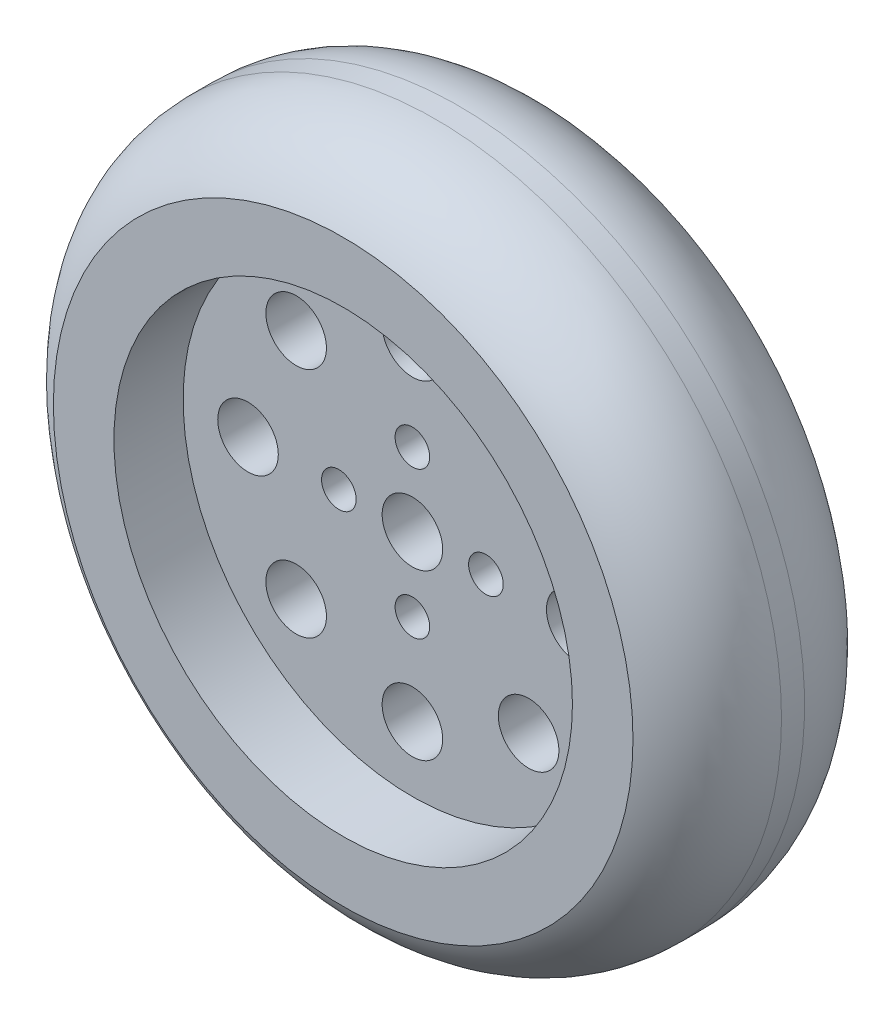
ISO-10303-21;
HEADER;
FILE_DESCRIPTION(('STEP AP214'),'2;1');
FILE_NAME('part.step','',(''),(''),'','','');
FILE_SCHEMA(('AUTOMOTIVE_DESIGN { 1 0 10303 214 1 1 1 1 }'));
ENDSEC;
DATA;
#1=APPLICATION_CONTEXT('core data for automotive mechanical design processes');
#2=APPLICATION_PROTOCOL_DEFINITION('international standard','automotive_design',2000,#1);
#3=PRODUCT_CONTEXT('',#1,'mechanical');
#4=PRODUCT('Part','Part','',(#3));
#5=PRODUCT_RELATED_PRODUCT_CATEGORY('part','',(#4));
#6=PRODUCT_DEFINITION_FORMATION('','',#4);
#7=PRODUCT_DEFINITION_CONTEXT('part definition',#1,'design');
#8=PRODUCT_DEFINITION('design','',#6,#7);
#9=PRODUCT_DEFINITION_SHAPE('','',#8);
#10=(LENGTH_UNIT() NAMED_UNIT(*) SI_UNIT(.MILLI.,.METRE.));
#11=(NAMED_UNIT(*) PLANE_ANGLE_UNIT() SI_UNIT($,.RADIAN.));
#12=(NAMED_UNIT(*) SI_UNIT($,.STERADIAN.) SOLID_ANGLE_UNIT());
#13=UNCERTAINTY_MEASURE_WITH_UNIT(LENGTH_MEASURE(1.E-05),#10,'distance_accuracy_value','');
#14=(GEOMETRIC_REPRESENTATION_CONTEXT(3) GLOBAL_UNCERTAINTY_ASSIGNED_CONTEXT((#13)) GLOBAL_UNIT_ASSIGNED_CONTEXT((#10,
#11,#12)) REPRESENTATION_CONTEXT('',''));
#15=CARTESIAN_POINT('',(0.,0.,0.));
#16=DIRECTION('',(0.,0.,1.));
#17=DIRECTION('',(1.,0.,0.));
#18=AXIS2_PLACEMENT_3D('',#15,#16,#17);
#19=CARTESIAN_POINT('',(0.,0.,24.));
#20=DIRECTION('',(0.,0.,-1.));
#21=DIRECTION('',(-1.,0.,0.));
#22=AXIS2_PLACEMENT_3D('',#19,#20,#21);
#23=CYLINDRICAL_SURFACE('',#22,40.);
#24=CARTESIAN_POINT('',(0.,0.,13.3346354961492));
#25=DIRECTION('',(0.,0.,1.));
#26=DIRECTION('',(1.,0.,0.));
#27=AXIS2_PLACEMENT_3D('',#24,#25,#26);
#28=CIRCLE('',#27,40.);
#29=CARTESIAN_POINT('',(40.,0.,13.3346354961492));
#30=VERTEX_POINT('',#29);
#31=EDGE_CURVE('E44',#30,#30,#28,.F.);
#32=ORIENTED_EDGE('',*,*,#31,.T.);
#33=EDGE_LOOP('',(#32));
#34=FACE_BOUND('',#33,.T.);
#35=CARTESIAN_POINT('',(0.,0.,10.6653645038508));
#36=DIRECTION('',(0.,0.,-1.));
#37=DIRECTION('',(-1.,0.,0.));
#38=AXIS2_PLACEMENT_3D('',#35,#36,#37);
#39=CIRCLE('',#38,40.);
#40=CARTESIAN_POINT('',(-40.,0.,10.6653645038508));
#41=VERTEX_POINT('',#40);
#42=EDGE_CURVE('E48',#41,#41,#39,.F.);
#43=ORIENTED_EDGE('',*,*,#42,.T.);
#44=EDGE_LOOP('',(#43));
#45=FACE_BOUND('',#44,.T.);
#46=ADVANCED_FACE('F33',(#34,#45),#23,.T.);
#47=CARTESIAN_POINT('',(0.,0.,10.6653645038508));
#48=DIRECTION('',(0.,0.,-1.));
#49=DIRECTION('',(-1.,0.,0.));
#50=AXIS2_PLACEMENT_3D('',#47,#48,#49);
#51=TOROIDAL_SURFACE('',#50,28.,12.);
#52=CARTESIAN_POINT('',(0.,0.,0.));
#53=DIRECTION('',(0.,0.,-1.));
#54=DIRECTION('',(-1.,0.,0.));
#55=AXIS2_PLACEMENT_3D('',#52,#53,#54);
#56=CIRCLE('',#55,33.5);
#57=CARTESIAN_POINT('',(-33.5,0.,0.));
#58=VERTEX_POINT('',#57);
#59=EDGE_CURVE('E53',#58,#58,#56,.T.);
#60=ORIENTED_EDGE('',*,*,#59,.F.);
#61=EDGE_LOOP('',(#60));
#62=FACE_BOUND('',#61,.T.);
#63=ORIENTED_EDGE('',*,*,#42,.F.);
#64=EDGE_LOOP('',(#63));
#65=FACE_BOUND('',#64,.T.);
#66=ADVANCED_FACE('F189',(#62,#65),#51,.T.);
#67=CARTESIAN_POINT('',(0.,0.,13.3346354961492));
#68=DIRECTION('',(0.,0.,1.));
#69=DIRECTION('',(1.,0.,0.));
#70=AXIS2_PLACEMENT_3D('',#67,#68,#69);
#71=TOROIDAL_SURFACE('',#70,28.,12.);
#72=ORIENTED_EDGE('',*,*,#31,.F.);
#73=EDGE_LOOP('',(#72));
#74=FACE_BOUND('',#73,.T.);
#75=CARTESIAN_POINT('',(0.,0.,24.));
#76=DIRECTION('',(0.,0.,1.));
#77=DIRECTION('',(1.,0.,0.));
#78=AXIS2_PLACEMENT_3D('',#75,#76,#77);
#79=CIRCLE('',#78,33.5);
#80=CARTESIAN_POINT('',(33.5,0.,24.));
#81=VERTEX_POINT('',#80);
#82=EDGE_CURVE('E56',#81,#81,#79,.T.);
#83=ORIENTED_EDGE('',*,*,#82,.F.);
#84=EDGE_LOOP('',(#83));
#85=FACE_BOUND('',#84,.T.);
#86=ADVANCED_FACE('F35',(#74,#85),#71,.T.);
#87=CARTESIAN_POINT('',(0.,0.,24.));
#88=DIRECTION('',(0.,0.,1.));
#89=DIRECTION('',(1.,0.,0.));
#90=AXIS2_PLACEMENT_3D('',#87,#88,#89);
#91=PLANE('',#90);
#92=ORIENTED_EDGE('',*,*,#82,.T.);
#93=EDGE_LOOP('',(#92));
#94=FACE_BOUND('',#93,.T.);
#95=CARTESIAN_POINT('',(0.,0.,24.));
#96=DIRECTION('',(0.,0.,1.));
#97=DIRECTION('',(1.,0.,0.));
#98=AXIS2_PLACEMENT_3D('',#95,#96,#97);
#99=CIRCLE('',#98,26.5);
#100=CARTESIAN_POINT('',(26.5,0.,24.));
#101=VERTEX_POINT('',#100);
#102=EDGE_CURVE('E59',#101,#101,#99,.T.);
#103=ORIENTED_EDGE('',*,*,#102,.F.);
#104=EDGE_LOOP('',(#103));
#105=FACE_BOUND('',#104,.T.);
#106=ADVANCED_FACE('F204',(#94,#105),#91,.T.);
#107=CARTESIAN_POINT('',(0.,0.,24.));
#108=DIRECTION('',(0.,0.,-1.));
#109=DIRECTION('',(-1.,0.,0.));
#110=AXIS2_PLACEMENT_3D('',#107,#108,#109);
#111=CYLINDRICAL_SURFACE('',#110,26.5);
#112=ORIENTED_EDGE('',*,*,#102,.T.);
#113=EDGE_LOOP('',(#112));
#114=FACE_BOUND('',#113,.T.);
#115=CARTESIAN_POINT('',(0.,0.,16.));
#116=DIRECTION('',(0.,0.,1.));
#117=DIRECTION('',(1.,0.,0.));
#118=AXIS2_PLACEMENT_3D('',#115,#116,#117);
#119=CIRCLE('',#118,26.5);
#120=CARTESIAN_POINT('',(26.5,0.,16.));
#121=VERTEX_POINT('',#120);
#122=EDGE_CURVE('E40',#121,#121,#119,.F.);
#123=ORIENTED_EDGE('',*,*,#122,.T.);
#124=EDGE_LOOP('',(#123));
#125=FACE_BOUND('',#124,.T.);
#126=ADVANCED_FACE('F202',(#114,#125),#111,.F.);
#127=CARTESIAN_POINT('',(0.,0.,16.));
#128=DIRECTION('',(0.,0.,1.));
#129=DIRECTION('',(1.,0.,0.));
#130=AXIS2_PLACEMENT_3D('',#127,#128,#129);
#131=PLANE('',#130);
#132=CARTESIAN_POINT('',(13.4350288425446,-13.4350288425442,16.));
#133=DIRECTION('',(0.,0.,1.));
#134=DIRECTION('',(1.,0.,0.));
#135=AXIS2_PLACEMENT_3D('',#132,#133,#134);
#136=CIRCLE('',#135,3.5);
#137=CARTESIAN_POINT('',(16.9350288425446,-13.4350288425442,16.));
#138=VERTEX_POINT('',#137);
#139=EDGE_CURVE('E137',#138,#138,#136,.T.);
#140=ORIENTED_EDGE('',*,*,#139,.F.);
#141=EDGE_LOOP('',(#140));
#142=FACE_BOUND('',#141,.T.);
#143=CARTESIAN_POINT('',(1.99014436314059E-13,-19.,16.));
#144=DIRECTION('',(0.,0.,1.));
#145=DIRECTION('',(1.,0.,0.));
#146=AXIS2_PLACEMENT_3D('',#143,#144,#145);
#147=CIRCLE('',#146,3.5);
#148=CARTESIAN_POINT('',(3.5000000000002,-19.,16.));
#149=VERTEX_POINT('',#148);
#150=EDGE_CURVE('E131',#149,#149,#147,.T.);
#151=ORIENTED_EDGE('',*,*,#150,.F.);
#152=EDGE_LOOP('',(#151));
#153=FACE_BOUND('',#152,.T.);
#154=CARTESIAN_POINT('',(-13.4350288425443,-13.4350288425445,16.));
#155=DIRECTION('',(0.,0.,1.));
#156=DIRECTION('',(1.,0.,0.));
#157=AXIS2_PLACEMENT_3D('',#154,#155,#156);
#158=CIRCLE('',#157,3.5);
#159=CARTESIAN_POINT('',(-9.93502884254429,-13.4350288425445,16.));
#160=VERTEX_POINT('',#159);
#161=EDGE_CURVE('E125',#160,#160,#158,.T.);
#162=ORIENTED_EDGE('',*,*,#161,.F.);
#163=EDGE_LOOP('',(#162));
#164=FACE_BOUND('',#163,.T.);
#165=CARTESIAN_POINT('',(-19.,-1.32676290876039E-13,16.));
#166=DIRECTION('',(0.,0.,1.));
#167=DIRECTION('',(1.,0.,0.));
#168=AXIS2_PLACEMENT_3D('',#165,#166,#167);
#169=CIRCLE('',#168,3.5);
#170=CARTESIAN_POINT('',(-15.5,-1.32676290876039E-13,16.));
#171=VERTEX_POINT('',#170);
#172=EDGE_CURVE('E119',#171,#171,#169,.T.);
#173=ORIENTED_EDGE('',*,*,#172,.F.);
#174=EDGE_LOOP('',(#173));
#175=FACE_BOUND('',#174,.T.);
#176=CARTESIAN_POINT('',(-13.4350288425445,13.4350288425443,16.));
#177=DIRECTION('',(0.,0.,1.));
#178=DIRECTION('',(1.,0.,0.));
#179=AXIS2_PLACEMENT_3D('',#176,#177,#178);
#180=CIRCLE('',#179,3.5);
#181=CARTESIAN_POINT('',(-9.93502884254448,13.4350288425443,16.));
#182=VERTEX_POINT('',#181);
#183=EDGE_CURVE('E113',#182,#182,#180,.T.);
#184=ORIENTED_EDGE('',*,*,#183,.F.);
#185=EDGE_LOOP('',(#184));
#186=FACE_BOUND('',#185,.T.);
#187=CARTESIAN_POINT('',(0.,19.,16.));
#188=DIRECTION('',(0.,0.,1.));
#189=DIRECTION('',(1.,0.,0.));
#190=AXIS2_PLACEMENT_3D('',#187,#188,#189);
#191=CIRCLE('',#190,3.5);
#192=CARTESIAN_POINT('',(3.49999999999993,19.,16.));
#193=VERTEX_POINT('',#192);
#194=EDGE_CURVE('E107',#193,#193,#191,.T.);
#195=ORIENTED_EDGE('',*,*,#194,.F.);
#196=EDGE_LOOP('',(#195));
#197=FACE_BOUND('',#196,.T.);
#198=CARTESIAN_POINT('',(13.4350288425444,13.4350288425444,16.));
#199=DIRECTION('',(0.,0.,1.));
#200=DIRECTION('',(1.,0.,0.));
#201=AXIS2_PLACEMENT_3D('',#198,#199,#200);
#202=CIRCLE('',#201,3.5);
#203=CARTESIAN_POINT('',(16.9350288425444,13.4350288425444,16.));
#204=VERTEX_POINT('',#203);
#205=EDGE_CURVE('E101',#204,#204,#202,.T.);
#206=ORIENTED_EDGE('',*,*,#205,.F.);
#207=EDGE_LOOP('',(#206));
#208=FACE_BOUND('',#207,.T.);
#209=CARTESIAN_POINT('',(0.,-8.5,16.));
#210=DIRECTION('',(0.,0.,1.));
#211=DIRECTION('',(1.,0.,0.));
#212=AXIS2_PLACEMENT_3D('',#209,#210,#211);
#213=CIRCLE('',#212,2.);
#214=CARTESIAN_POINT('',(2.00000000000009,-8.5,16.));
#215=VERTEX_POINT('',#214);
#216=EDGE_CURVE('E95',#215,#215,#213,.T.);
#217=ORIENTED_EDGE('',*,*,#216,.F.);
#218=EDGE_LOOP('',(#217));
#219=FACE_BOUND('',#218,.T.);
#220=CARTESIAN_POINT('',(-8.5,0.,16.));
#221=DIRECTION('',(0.,0.,1.));
#222=DIRECTION('',(1.,0.,0.));
#223=AXIS2_PLACEMENT_3D('',#220,#221,#222);
#224=CIRCLE('',#223,2.);
#225=CARTESIAN_POINT('',(-6.5,0.,16.));
#226=VERTEX_POINT('',#225);
#227=EDGE_CURVE('E89',#226,#226,#224,.T.);
#228=ORIENTED_EDGE('',*,*,#227,.F.);
#229=EDGE_LOOP('',(#228));
#230=FACE_BOUND('',#229,.T.);
#231=CARTESIAN_POINT('',(0.,8.5,16.));
#232=DIRECTION('',(0.,0.,1.));
#233=DIRECTION('',(1.,0.,0.));
#234=AXIS2_PLACEMENT_3D('',#231,#232,#233);
#235=CIRCLE('',#234,2.);
#236=CARTESIAN_POINT('',(1.99999999999997,8.5,16.));
#237=VERTEX_POINT('',#236);
#238=EDGE_CURVE('E83',#237,#237,#235,.T.);
#239=ORIENTED_EDGE('',*,*,#238,.F.);
#240=EDGE_LOOP('',(#239));
#241=FACE_BOUND('',#240,.T.);
#242=CARTESIAN_POINT('',(19.,0.,16.));
#243=DIRECTION('',(0.,0.,1.));
#244=DIRECTION('',(1.,0.,0.));
#245=AXIS2_PLACEMENT_3D('',#242,#243,#244);
#246=CIRCLE('',#245,3.5);
#247=CARTESIAN_POINT('',(22.5,0.,16.));
#248=VERTEX_POINT('',#247);
#249=EDGE_CURVE('E77',#248,#248,#246,.T.);
#250=ORIENTED_EDGE('',*,*,#249,.F.);
#251=EDGE_LOOP('',(#250));
#252=FACE_BOUND('',#251,.T.);
#253=CARTESIAN_POINT('',(8.5,0.,16.));
#254=DIRECTION('',(0.,0.,1.));
#255=DIRECTION('',(1.,0.,0.));
#256=AXIS2_PLACEMENT_3D('',#253,#254,#255);
#257=CIRCLE('',#256,2.);
#258=CARTESIAN_POINT('',(10.5,0.,16.));
#259=VERTEX_POINT('',#258);
#260=EDGE_CURVE('E71',#259,#259,#257,.T.);
#261=ORIENTED_EDGE('',*,*,#260,.F.);
#262=EDGE_LOOP('',(#261));
#263=FACE_BOUND('',#262,.T.);
#264=CARTESIAN_POINT('',(0.,0.,16.));
#265=DIRECTION('',(0.,0.,1.));
#266=DIRECTION('',(1.,0.,0.));
#267=AXIS2_PLACEMENT_3D('',#264,#265,#266);
#268=CIRCLE('',#267,3.5);
#269=CARTESIAN_POINT('',(3.5,0.,16.));
#270=VERTEX_POINT('',#269);
#271=EDGE_CURVE('E65',#270,#270,#268,.T.);
#272=ORIENTED_EDGE('',*,*,#271,.F.);
#273=EDGE_LOOP('',(#272));
#274=FACE_BOUND('',#273,.T.);
#275=ORIENTED_EDGE('',*,*,#122,.F.);
#276=EDGE_LOOP('',(#275));
#277=FACE_BOUND('',#276,.T.);
#278=ADVANCED_FACE('F198',(#142,#153,#164,#175,#186,#197,#208,#219,#230,#241,#252,#263,#274,
#277),#131,.T.);
#279=CARTESIAN_POINT('',(0.,0.,0.));
#280=DIRECTION('',(0.,0.,-1.));
#281=DIRECTION('',(-1.,0.,0.));
#282=AXIS2_PLACEMENT_3D('',#279,#280,#281);
#283=PLANE('',#282);
#284=ORIENTED_EDGE('',*,*,#59,.T.);
#285=EDGE_LOOP('',(#284));
#286=FACE_BOUND('',#285,.T.);
#287=CARTESIAN_POINT('',(0.,0.,0.));
#288=DIRECTION('',(0.,0.,-1.));
#289=DIRECTION('',(-1.,0.,0.));
#290=AXIS2_PLACEMENT_3D('',#287,#288,#289);
#291=CIRCLE('',#290,26.5);
#292=CARTESIAN_POINT('',(-26.5,0.,0.));
#293=VERTEX_POINT('',#292);
#294=EDGE_CURVE('E62',#293,#293,#291,.T.);
#295=ORIENTED_EDGE('',*,*,#294,.F.);
#296=EDGE_LOOP('',(#295));
#297=FACE_BOUND('',#296,.T.);
#298=ADVANCED_FACE('F201',(#286,#297),#283,.T.);
#299=CARTESIAN_POINT('',(0.,0.,0.));
#300=DIRECTION('',(0.,0.,1.));
#301=DIRECTION('',(1.,0.,0.));
#302=AXIS2_PLACEMENT_3D('',#299,#300,#301);
#303=CYLINDRICAL_SURFACE('',#302,26.5);
#304=ORIENTED_EDGE('',*,*,#294,.T.);
#305=EDGE_LOOP('',(#304));
#306=FACE_BOUND('',#305,.T.);
#307=CARTESIAN_POINT('',(0.,0.,8.));
#308=DIRECTION('',(0.,0.,-1.));
#309=DIRECTION('',(-1.,0.,0.));
#310=AXIS2_PLACEMENT_3D('',#307,#308,#309);
#311=CIRCLE('',#310,26.5);
#312=CARTESIAN_POINT('',(-26.5,0.,8.));
#313=VERTEX_POINT('',#312);
#314=EDGE_CURVE('E10',#313,#313,#311,.F.);
#315=ORIENTED_EDGE('',*,*,#314,.T.);
#316=EDGE_LOOP('',(#315));
#317=FACE_BOUND('',#316,.T.);
#318=ADVANCED_FACE('F150',(#306,#317),#303,.F.);
#319=CARTESIAN_POINT('',(0.,0.,8.));
#320=DIRECTION('',(0.,0.,-1.));
#321=DIRECTION('',(-1.,0.,0.));
#322=AXIS2_PLACEMENT_3D('',#319,#320,#321);
#323=PLANE('',#322);
#324=CARTESIAN_POINT('',(13.4350288425446,-13.4350288425442,8.));
#325=DIRECTION('',(0.,0.,-1.));
#326=DIRECTION('',(-1.,0.,0.));
#327=AXIS2_PLACEMENT_3D('',#324,#325,#326);
#328=CIRCLE('',#327,3.5);
#329=CARTESIAN_POINT('',(9.93502884254457,-13.4350288425442,8.));
#330=VERTEX_POINT('',#329);
#331=EDGE_CURVE('E140',#330,#330,#328,.T.);
#332=ORIENTED_EDGE('',*,*,#331,.F.);
#333=EDGE_LOOP('',(#332));
#334=FACE_BOUND('',#333,.T.);
#335=CARTESIAN_POINT('',(1.99014436314059E-13,-19.,8.));
#336=DIRECTION('',(0.,0.,-1.));
#337=DIRECTION('',(-1.,0.,0.));
#338=AXIS2_PLACEMENT_3D('',#335,#336,#337);
#339=CIRCLE('',#338,3.5);
#340=CARTESIAN_POINT('',(-3.4999999999998,-19.,8.));
#341=VERTEX_POINT('',#340);
#342=EDGE_CURVE('E134',#341,#341,#339,.T.);
#343=ORIENTED_EDGE('',*,*,#342,.F.);
#344=EDGE_LOOP('',(#343));
#345=FACE_BOUND('',#344,.T.);
#346=CARTESIAN_POINT('',(-13.4350288425443,-13.4350288425445,8.));
#347=DIRECTION('',(0.,0.,-1.));
#348=DIRECTION('',(-1.,0.,0.));
#349=AXIS2_PLACEMENT_3D('',#346,#347,#348);
#350=CIRCLE('',#349,3.5);
#351=CARTESIAN_POINT('',(-16.9350288425443,-13.4350288425445,8.));
#352=VERTEX_POINT('',#351);
#353=EDGE_CURVE('E128',#352,#352,#350,.T.);
#354=ORIENTED_EDGE('',*,*,#353,.F.);
#355=EDGE_LOOP('',(#354));
#356=FACE_BOUND('',#355,.T.);
#357=CARTESIAN_POINT('',(-19.,-1.32676290876039E-13,8.));
#358=DIRECTION('',(0.,0.,-1.));
#359=DIRECTION('',(-1.,0.,0.));
#360=AXIS2_PLACEMENT_3D('',#357,#358,#359);
#361=CIRCLE('',#360,3.5);
#362=CARTESIAN_POINT('',(-22.5,-1.32676290876039E-13,8.));
#363=VERTEX_POINT('',#362);
#364=EDGE_CURVE('E122',#363,#363,#361,.T.);
#365=ORIENTED_EDGE('',*,*,#364,.F.);
#366=EDGE_LOOP('',(#365));
#367=FACE_BOUND('',#366,.T.);
#368=CARTESIAN_POINT('',(-13.4350288425445,13.4350288425443,8.));
#369=DIRECTION('',(0.,0.,-1.));
#370=DIRECTION('',(-1.,0.,0.));
#371=AXIS2_PLACEMENT_3D('',#368,#369,#370);
#372=CIRCLE('',#371,3.5);
#373=CARTESIAN_POINT('',(-16.9350288425445,13.4350288425443,8.));
#374=VERTEX_POINT('',#373);
#375=EDGE_CURVE('E116',#374,#374,#372,.T.);
#376=ORIENTED_EDGE('',*,*,#375,.F.);
#377=EDGE_LOOP('',(#376));
#378=FACE_BOUND('',#377,.T.);
#379=CARTESIAN_POINT('',(0.,19.,8.));
#380=DIRECTION('',(0.,0.,-1.));
#381=DIRECTION('',(-1.,0.,0.));
#382=AXIS2_PLACEMENT_3D('',#379,#380,#381);
#383=CIRCLE('',#382,3.5);
#384=CARTESIAN_POINT('',(-3.50000000000007,19.,8.));
#385=VERTEX_POINT('',#384);
#386=EDGE_CURVE('E110',#385,#385,#383,.T.);
#387=ORIENTED_EDGE('',*,*,#386,.F.);
#388=EDGE_LOOP('',(#387));
#389=FACE_BOUND('',#388,.T.);
#390=CARTESIAN_POINT('',(13.4350288425444,13.4350288425444,8.));
#391=DIRECTION('',(0.,0.,-1.));
#392=DIRECTION('',(-1.,0.,0.));
#393=AXIS2_PLACEMENT_3D('',#390,#391,#392);
#394=CIRCLE('',#393,3.5);
#395=CARTESIAN_POINT('',(9.93502884254438,13.4350288425444,8.));
#396=VERTEX_POINT('',#395);
#397=EDGE_CURVE('E104',#396,#396,#394,.T.);
#398=ORIENTED_EDGE('',*,*,#397,.F.);
#399=EDGE_LOOP('',(#398));
#400=FACE_BOUND('',#399,.T.);
#401=CARTESIAN_POINT('',(0.,-8.5,8.));
#402=DIRECTION('',(0.,0.,-1.));
#403=DIRECTION('',(-1.,0.,0.));
#404=AXIS2_PLACEMENT_3D('',#401,#402,#403);
#405=CIRCLE('',#404,2.);
#406=CARTESIAN_POINT('',(-1.99999999999991,-8.5,8.));
#407=VERTEX_POINT('',#406);
#408=EDGE_CURVE('E98',#407,#407,#405,.T.);
#409=ORIENTED_EDGE('',*,*,#408,.F.);
#410=EDGE_LOOP('',(#409));
#411=FACE_BOUND('',#410,.T.);
#412=CARTESIAN_POINT('',(-8.5,0.,8.));
#413=DIRECTION('',(0.,0.,-1.));
#414=DIRECTION('',(-1.,0.,0.));
#415=AXIS2_PLACEMENT_3D('',#412,#413,#414);
#416=CIRCLE('',#415,2.);
#417=CARTESIAN_POINT('',(-10.5,0.,8.));
#418=VERTEX_POINT('',#417);
#419=EDGE_CURVE('E92',#418,#418,#416,.T.);
#420=ORIENTED_EDGE('',*,*,#419,.F.);
#421=EDGE_LOOP('',(#420));
#422=FACE_BOUND('',#421,.T.);
#423=CARTESIAN_POINT('',(0.,8.5,8.));
#424=DIRECTION('',(0.,0.,-1.));
#425=DIRECTION('',(-1.,0.,0.));
#426=AXIS2_PLACEMENT_3D('',#423,#424,#425);
#427=CIRCLE('',#426,2.);
#428=CARTESIAN_POINT('',(-2.00000000000003,8.5,8.));
#429=VERTEX_POINT('',#428);
#430=EDGE_CURVE('E86',#429,#429,#427,.T.);
#431=ORIENTED_EDGE('',*,*,#430,.F.);
#432=EDGE_LOOP('',(#431));
#433=FACE_BOUND('',#432,.T.);
#434=CARTESIAN_POINT('',(19.,0.,8.));
#435=DIRECTION('',(0.,0.,-1.));
#436=DIRECTION('',(-1.,0.,0.));
#437=AXIS2_PLACEMENT_3D('',#434,#435,#436);
#438=CIRCLE('',#437,3.5);
#439=CARTESIAN_POINT('',(15.5,0.,8.));
#440=VERTEX_POINT('',#439);
#441=EDGE_CURVE('E80',#440,#440,#438,.T.);
#442=ORIENTED_EDGE('',*,*,#441,.F.);
#443=EDGE_LOOP('',(#442));
#444=FACE_BOUND('',#443,.T.);
#445=CARTESIAN_POINT('',(8.5,0.,8.));
#446=DIRECTION('',(0.,0.,-1.));
#447=DIRECTION('',(-1.,0.,0.));
#448=AXIS2_PLACEMENT_3D('',#445,#446,#447);
#449=CIRCLE('',#448,2.);
#450=CARTESIAN_POINT('',(6.5,0.,8.));
#451=VERTEX_POINT('',#450);
#452=EDGE_CURVE('E74',#451,#451,#449,.T.);
#453=ORIENTED_EDGE('',*,*,#452,.F.);
#454=EDGE_LOOP('',(#453));
#455=FACE_BOUND('',#454,.T.);
#456=CARTESIAN_POINT('',(0.,0.,8.));
#457=DIRECTION('',(0.,0.,-1.));
#458=DIRECTION('',(-1.,0.,0.));
#459=AXIS2_PLACEMENT_3D('',#456,#457,#458);
#460=CIRCLE('',#459,3.5);
#461=CARTESIAN_POINT('',(-3.5,0.,8.));
#462=VERTEX_POINT('',#461);
#463=EDGE_CURVE('E68',#462,#462,#460,.T.);
#464=ORIENTED_EDGE('',*,*,#463,.F.);
#465=EDGE_LOOP('',(#464));
#466=FACE_BOUND('',#465,.T.);
#467=ORIENTED_EDGE('',*,*,#314,.F.);
#468=EDGE_LOOP('',(#467));
#469=FACE_BOUND('',#468,.T.);
#470=ADVANCED_FACE('F146',(#334,#345,#356,#367,#378,#389,#400,#411,#422,#433,#444,#455,#466,
#469),#323,.T.);
#471=CARTESIAN_POINT('',(0.,0.,24.));
#472=DIRECTION('',(0.,0.,-1.));
#473=DIRECTION('',(-1.,0.,0.));
#474=AXIS2_PLACEMENT_3D('',#471,#472,#473);
#475=CYLINDRICAL_SURFACE('',#474,3.5);
#476=ORIENTED_EDGE('',*,*,#271,.T.);
#477=EDGE_LOOP('',(#476));
#478=FACE_BOUND('',#477,.T.);
#479=ORIENTED_EDGE('',*,*,#463,.T.);
#480=EDGE_LOOP('',(#479));
#481=FACE_BOUND('',#480,.T.);
#482=ADVANCED_FACE('F149',(#478,#481),#475,.F.);
#483=CARTESIAN_POINT('',(8.5,0.,24.));
#484=DIRECTION('',(0.,0.,-1.));
#485=DIRECTION('',(-1.,0.,0.));
#486=AXIS2_PLACEMENT_3D('',#483,#484,#485);
#487=CYLINDRICAL_SURFACE('',#486,2.);
#488=ORIENTED_EDGE('',*,*,#260,.T.);
#489=EDGE_LOOP('',(#488));
#490=FACE_BOUND('',#489,.T.);
#491=ORIENTED_EDGE('',*,*,#452,.T.);
#492=EDGE_LOOP('',(#491));
#493=FACE_BOUND('',#492,.T.);
#494=ADVANCED_FACE('F178',(#490,#493),#487,.F.);
#495=CARTESIAN_POINT('',(19.,0.,24.));
#496=DIRECTION('',(0.,0.,-1.));
#497=DIRECTION('',(-1.,0.,0.));
#498=AXIS2_PLACEMENT_3D('',#495,#496,#497);
#499=CYLINDRICAL_SURFACE('',#498,3.5);
#500=ORIENTED_EDGE('',*,*,#249,.T.);
#501=EDGE_LOOP('',(#500));
#502=FACE_BOUND('',#501,.T.);
#503=ORIENTED_EDGE('',*,*,#441,.T.);
#504=EDGE_LOOP('',(#503));
#505=FACE_BOUND('',#504,.T.);
#506=ADVANCED_FACE('F184',(#502,#505),#499,.F.);
#507=CARTESIAN_POINT('',(0.,8.5,24.));
#508=DIRECTION('',(0.,0.,-1.));
#509=DIRECTION('',(-1.,0.,0.));
#510=AXIS2_PLACEMENT_3D('',#507,#508,#509);
#511=CYLINDRICAL_SURFACE('',#510,2.);
#512=ORIENTED_EDGE('',*,*,#238,.T.);
#513=EDGE_LOOP('',(#512));
#514=FACE_BOUND('',#513,.T.);
#515=ORIENTED_EDGE('',*,*,#430,.T.);
#516=EDGE_LOOP('',(#515));
#517=FACE_BOUND('',#516,.T.);
#518=ADVANCED_FACE('F317',(#514,#517),#511,.F.);
#519=CARTESIAN_POINT('',(-8.5,0.,24.));
#520=DIRECTION('',(0.,0.,-1.));
#521=DIRECTION('',(-1.,0.,0.));
#522=AXIS2_PLACEMENT_3D('',#519,#520,#521);
#523=CYLINDRICAL_SURFACE('',#522,2.);
#524=ORIENTED_EDGE('',*,*,#227,.T.);
#525=EDGE_LOOP('',(#524));
#526=FACE_BOUND('',#525,.T.);
#527=ORIENTED_EDGE('',*,*,#419,.T.);
#528=EDGE_LOOP('',(#527));
#529=FACE_BOUND('',#528,.T.);
#530=ADVANCED_FACE('F308',(#526,#529),#523,.F.);
#531=CARTESIAN_POINT('',(0.,-8.5,24.));
#532=DIRECTION('',(0.,0.,-1.));
#533=DIRECTION('',(-1.,0.,0.));
#534=AXIS2_PLACEMENT_3D('',#531,#532,#533);
#535=CYLINDRICAL_SURFACE('',#534,2.);
#536=ORIENTED_EDGE('',*,*,#216,.T.);
#537=EDGE_LOOP('',(#536));
#538=FACE_BOUND('',#537,.T.);
#539=ORIENTED_EDGE('',*,*,#408,.T.);
#540=EDGE_LOOP('',(#539));
#541=FACE_BOUND('',#540,.T.);
#542=ADVANCED_FACE('F299',(#538,#541),#535,.F.);
#543=CARTESIAN_POINT('',(13.4350288425444,13.4350288425444,24.));
#544=DIRECTION('',(0.,0.,-1.));
#545=DIRECTION('',(-1.,0.,0.));
#546=AXIS2_PLACEMENT_3D('',#543,#544,#545);
#547=CYLINDRICAL_SURFACE('',#546,3.5);
#548=ORIENTED_EDGE('',*,*,#205,.T.);
#549=EDGE_LOOP('',(#548));
#550=FACE_BOUND('',#549,.T.);
#551=ORIENTED_EDGE('',*,*,#397,.T.);
#552=EDGE_LOOP('',(#551));
#553=FACE_BOUND('',#552,.T.);
#554=ADVANCED_FACE('F290',(#550,#553),#547,.F.);
#555=CARTESIAN_POINT('',(0.,19.,24.));
#556=DIRECTION('',(0.,0.,-1.));
#557=DIRECTION('',(-1.,0.,0.));
#558=AXIS2_PLACEMENT_3D('',#555,#556,#557);
#559=CYLINDRICAL_SURFACE('',#558,3.5);
#560=ORIENTED_EDGE('',*,*,#194,.T.);
#561=EDGE_LOOP('',(#560));
#562=FACE_BOUND('',#561,.T.);
#563=ORIENTED_EDGE('',*,*,#386,.T.);
#564=EDGE_LOOP('',(#563));
#565=FACE_BOUND('',#564,.T.);
#566=ADVANCED_FACE('F281',(#562,#565),#559,.F.);
#567=CARTESIAN_POINT('',(-13.4350288425445,13.4350288425443,24.));
#568=DIRECTION('',(0.,0.,-1.));
#569=DIRECTION('',(-1.,0.,0.));
#570=AXIS2_PLACEMENT_3D('',#567,#568,#569);
#571=CYLINDRICAL_SURFACE('',#570,3.5);
#572=ORIENTED_EDGE('',*,*,#183,.T.);
#573=EDGE_LOOP('',(#572));
#574=FACE_BOUND('',#573,.T.);
#575=ORIENTED_EDGE('',*,*,#375,.T.);
#576=EDGE_LOOP('',(#575));
#577=FACE_BOUND('',#576,.T.);
#578=ADVANCED_FACE('F273',(#574,#577),#571,.F.);
#579=CARTESIAN_POINT('',(-19.,-1.32676290876039E-13,24.));
#580=DIRECTION('',(0.,0.,-1.));
#581=DIRECTION('',(-1.,0.,0.));
#582=AXIS2_PLACEMENT_3D('',#579,#580,#581);
#583=CYLINDRICAL_SURFACE('',#582,3.5);
#584=ORIENTED_EDGE('',*,*,#172,.T.);
#585=EDGE_LOOP('',(#584));
#586=FACE_BOUND('',#585,.T.);
#587=ORIENTED_EDGE('',*,*,#364,.T.);
#588=EDGE_LOOP('',(#587));
#589=FACE_BOUND('',#588,.T.);
#590=ADVANCED_FACE('F239',(#586,#589),#583,.F.);
#591=CARTESIAN_POINT('',(-13.4350288425443,-13.4350288425445,24.));
#592=DIRECTION('',(0.,0.,-1.));
#593=DIRECTION('',(-1.,0.,0.));
#594=AXIS2_PLACEMENT_3D('',#591,#592,#593);
#595=CYLINDRICAL_SURFACE('',#594,3.5);
#596=ORIENTED_EDGE('',*,*,#161,.T.);
#597=EDGE_LOOP('',(#596));
#598=FACE_BOUND('',#597,.T.);
#599=ORIENTED_EDGE('',*,*,#353,.T.);
#600=EDGE_LOOP('',(#599));
#601=FACE_BOUND('',#600,.T.);
#602=ADVANCED_FACE('F234',(#598,#601),#595,.F.);
#603=CARTESIAN_POINT('',(1.99014436314059E-13,-19.,24.));
#604=DIRECTION('',(0.,0.,-1.));
#605=DIRECTION('',(-1.,0.,0.));
#606=AXIS2_PLACEMENT_3D('',#603,#604,#605);
#607=CYLINDRICAL_SURFACE('',#606,3.5);
#608=ORIENTED_EDGE('',*,*,#150,.T.);
#609=EDGE_LOOP('',(#608));
#610=FACE_BOUND('',#609,.T.);
#611=ORIENTED_EDGE('',*,*,#342,.T.);
#612=EDGE_LOOP('',(#611));
#613=FACE_BOUND('',#612,.T.);
#614=ADVANCED_FACE('F238',(#610,#613),#607,.F.);
#615=CARTESIAN_POINT('',(13.4350288425446,-13.4350288425442,24.));
#616=DIRECTION('',(0.,0.,-1.));
#617=DIRECTION('',(-1.,0.,0.));
#618=AXIS2_PLACEMENT_3D('',#615,#616,#617);
#619=CYLINDRICAL_SURFACE('',#618,3.5);
#620=ORIENTED_EDGE('',*,*,#139,.T.);
#621=EDGE_LOOP('',(#620));
#622=FACE_BOUND('',#621,.T.);
#623=ORIENTED_EDGE('',*,*,#331,.T.);
#624=EDGE_LOOP('',(#623));
#625=FACE_BOUND('',#624,.T.);
#626=ADVANCED_FACE('F144',(#622,#625),#619,.F.);
#627=CLOSED_SHELL('',(#46,#66,#86,#106,#126,#278,#298,#318,#470,#482,#494,#506,#518,#530,#542,
#554,#566,#578,#590,#602,#614,#626));
#628=MANIFOLD_SOLID_BREP('B2',#627);
#629=ADVANCED_BREP_SHAPE_REPRESENTATION('',(#18,#628),#14);
#630=SHAPE_DEFINITION_REPRESENTATION(#9,#629);
ENDSEC;
END-ISO-10303-21;
